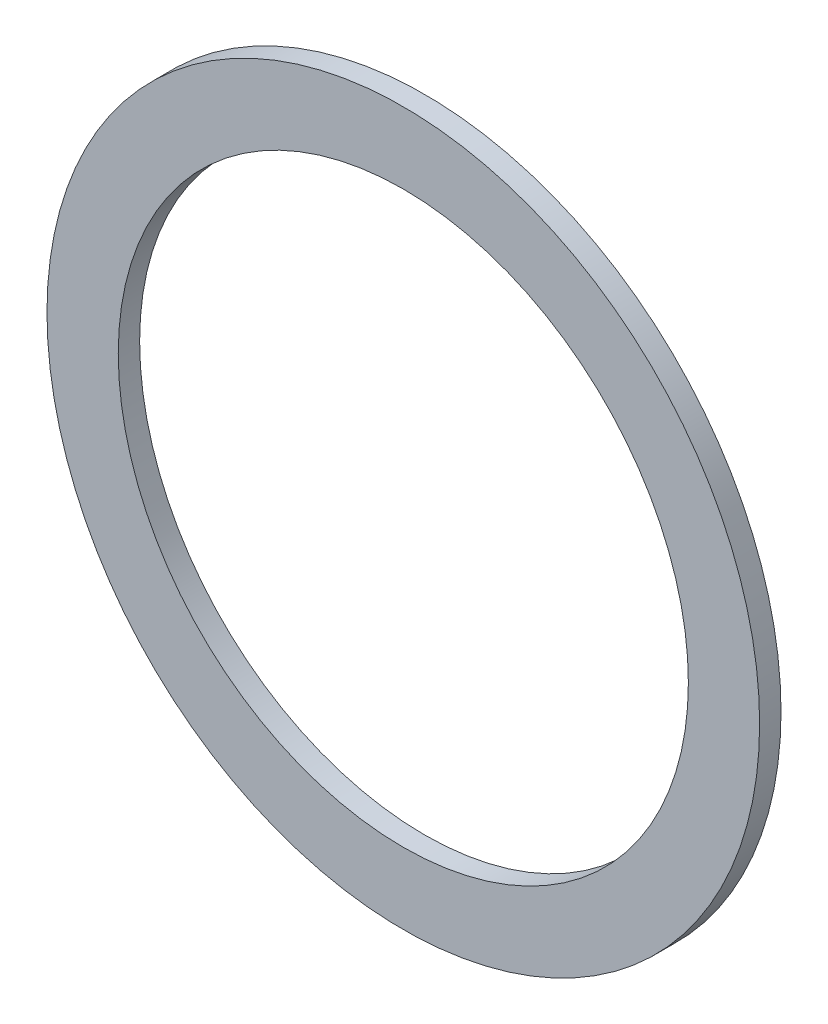
ISO-10303-21;
HEADER;
FILE_DESCRIPTION(('STEP AP214'),'2;1');
FILE_NAME('part.step','',(''),(''),'','','');
FILE_SCHEMA(('AUTOMOTIVE_DESIGN { 1 0 10303 214 1 1 1 1 }'));
ENDSEC;
DATA;
#1=APPLICATION_CONTEXT('core data for automotive mechanical design processes');
#2=APPLICATION_PROTOCOL_DEFINITION('international standard','automotive_design',2000,#1);
#3=PRODUCT_CONTEXT('',#1,'mechanical');
#4=PRODUCT('Part','Part','',(#3));
#5=PRODUCT_RELATED_PRODUCT_CATEGORY('part','',(#4));
#6=PRODUCT_DEFINITION_FORMATION('','',#4);
#7=PRODUCT_DEFINITION_CONTEXT('part definition',#1,'design');
#8=PRODUCT_DEFINITION('design','',#6,#7);
#9=PRODUCT_DEFINITION_SHAPE('','',#8);
#10=(LENGTH_UNIT() NAMED_UNIT(*) SI_UNIT(.MILLI.,.METRE.));
#11=(NAMED_UNIT(*) PLANE_ANGLE_UNIT() SI_UNIT($,.RADIAN.));
#12=(NAMED_UNIT(*) SI_UNIT($,.STERADIAN.) SOLID_ANGLE_UNIT());
#13=UNCERTAINTY_MEASURE_WITH_UNIT(LENGTH_MEASURE(1.E-05),#10,'distance_accuracy_value','');
#14=(GEOMETRIC_REPRESENTATION_CONTEXT(3) GLOBAL_UNCERTAINTY_ASSIGNED_CONTEXT((#13)) GLOBAL_UNIT_ASSIGNED_CONTEXT((#10,
#11,#12)) REPRESENTATION_CONTEXT('',''));
#15=CARTESIAN_POINT('',(0.,0.,0.));
#16=DIRECTION('',(0.,0.,1.));
#17=DIRECTION('',(1.,0.,0.));
#18=AXIS2_PLACEMENT_3D('',#15,#16,#17);
#19=CARTESIAN_POINT('',(0.,0.,0.075));
#20=DIRECTION('',(0.,0.,1.));
#21=DIRECTION('',(1.,0.,0.));
#22=AXIS2_PLACEMENT_3D('',#19,#20,#21);
#23=PLANE('',#22);
#24=CARTESIAN_POINT('',(0.,0.,0.075));
#25=DIRECTION('',(0.,0.,1.));
#26=DIRECTION('',(1.,0.,0.));
#27=AXIS2_PLACEMENT_3D('',#24,#25,#26);
#28=CIRCLE('',#27,1.);
#29=CARTESIAN_POINT('',(1.,0.,0.075));
#30=VERTEX_POINT('',#29);
#31=EDGE_CURVE('E10',#30,#30,#28,.T.);
#32=ORIENTED_EDGE('',*,*,#31,.F.);
#33=EDGE_LOOP('',(#32));
#34=FACE_BOUND('',#33,.T.);
#35=CARTESIAN_POINT('',(0.,0.,0.075));
#36=DIRECTION('',(0.,0.,1.));
#37=DIRECTION('',(1.,0.,0.));
#38=AXIS2_PLACEMENT_3D('',#35,#36,#37);
#39=CIRCLE('',#38,1.25);
#40=CARTESIAN_POINT('',(1.25,0.,0.075));
#41=VERTEX_POINT('',#40);
#42=EDGE_CURVE('E52',#41,#41,#39,.T.);
#43=ORIENTED_EDGE('',*,*,#42,.T.);
#44=EDGE_LOOP('',(#43));
#45=FACE_BOUND('',#44,.T.);
#46=ADVANCED_FACE('F38',(#34,#45),#23,.T.);
#47=CARTESIAN_POINT('',(0.,0.,0.));
#48=DIRECTION('',(0.,0.,1.));
#49=DIRECTION('',(1.,0.,0.));
#50=AXIS2_PLACEMENT_3D('',#47,#48,#49);
#51=PLANE('',#50);
#52=CARTESIAN_POINT('',(0.,0.,0.));
#53=DIRECTION('',(0.,0.,1.));
#54=DIRECTION('',(1.,0.,0.));
#55=AXIS2_PLACEMENT_3D('',#52,#53,#54);
#56=CIRCLE('',#55,1.);
#57=CARTESIAN_POINT('',(1.,0.,0.));
#58=VERTEX_POINT('',#57);
#59=EDGE_CURVE('E46',#58,#58,#56,.T.);
#60=ORIENTED_EDGE('',*,*,#59,.T.);
#61=EDGE_LOOP('',(#60));
#62=FACE_BOUND('',#61,.T.);
#63=CARTESIAN_POINT('',(0.,0.,0.));
#64=DIRECTION('',(0.,0.,1.));
#65=DIRECTION('',(1.,0.,0.));
#66=AXIS2_PLACEMENT_3D('',#63,#64,#65);
#67=CIRCLE('',#66,1.25);
#68=CARTESIAN_POINT('',(1.25,0.,0.));
#69=VERTEX_POINT('',#68);
#70=EDGE_CURVE('E42',#69,#69,#67,.T.);
#71=ORIENTED_EDGE('',*,*,#70,.F.);
#72=EDGE_LOOP('',(#71));
#73=FACE_BOUND('',#72,.T.);
#74=ADVANCED_FACE('F40',(#62,#73),#51,.F.);
#75=CARTESIAN_POINT('',(0.,0.,0.075));
#76=DIRECTION('',(0.,0.,-1.));
#77=DIRECTION('',(-1.,0.,0.));
#78=AXIS2_PLACEMENT_3D('',#75,#76,#77);
#79=CYLINDRICAL_SURFACE('',#78,1.);
#80=ORIENTED_EDGE('',*,*,#31,.T.);
#81=EDGE_LOOP('',(#80));
#82=FACE_BOUND('',#81,.T.);
#83=ORIENTED_EDGE('',*,*,#59,.F.);
#84=EDGE_LOOP('',(#83));
#85=FACE_BOUND('',#84,.T.);
#86=ADVANCED_FACE('F62',(#82,#85),#79,.F.);
#87=CARTESIAN_POINT('',(0.,0.,-9.925));
#88=DIRECTION('',(0.,0.,1.));
#89=DIRECTION('',(1.,0.,0.));
#90=AXIS2_PLACEMENT_3D('',#87,#88,#89);
#91=CYLINDRICAL_SURFACE('',#90,1.25);
#92=ORIENTED_EDGE('',*,*,#42,.F.);
#93=EDGE_LOOP('',(#92));
#94=FACE_BOUND('',#93,.T.);
#95=ORIENTED_EDGE('',*,*,#70,.T.);
#96=EDGE_LOOP('',(#95));
#97=FACE_BOUND('',#96,.T.);
#98=ADVANCED_FACE('F59',(#94,#97),#91,.T.);
#99=CLOSED_SHELL('',(#46,#74,#86,#98));
#100=MANIFOLD_SOLID_BREP('B2',#99);
#101=ADVANCED_BREP_SHAPE_REPRESENTATION('',(#18,#100),#14);
#102=SHAPE_DEFINITION_REPRESENTATION(#9,#101);
ENDSEC;
END-ISO-10303-21;
